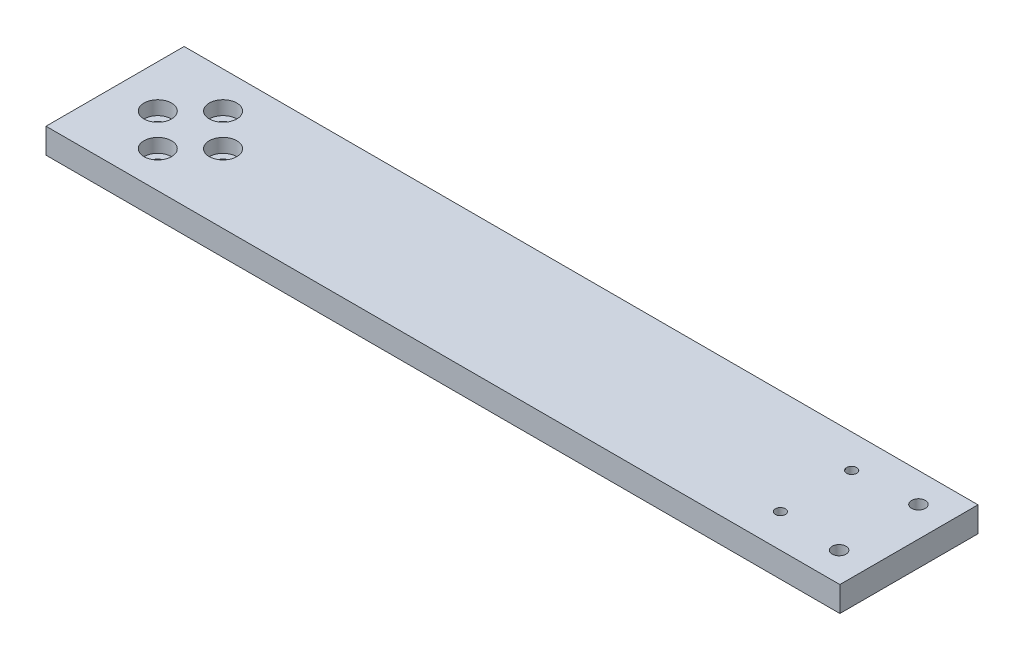
ISO-10303-21;
HEADER;
FILE_DESCRIPTION(('STEP AP214'),'2;1');
FILE_NAME('part.step','',(''),(''),'','','');
FILE_SCHEMA(('AUTOMOTIVE_DESIGN { 1 0 10303 214 1 1 1 1 }'));
ENDSEC;
DATA;
#1=APPLICATION_CONTEXT('core data for automotive mechanical design processes');
#2=APPLICATION_PROTOCOL_DEFINITION('international standard','automotive_design',2000,#1);
#3=PRODUCT_CONTEXT('',#1,'mechanical');
#4=PRODUCT('Part','Part','',(#3));
#5=PRODUCT_RELATED_PRODUCT_CATEGORY('part','',(#4));
#6=PRODUCT_DEFINITION_FORMATION('','',#4);
#7=PRODUCT_DEFINITION_CONTEXT('part definition',#1,'design');
#8=PRODUCT_DEFINITION('design','',#6,#7);
#9=PRODUCT_DEFINITION_SHAPE('','',#8);
#10=(LENGTH_UNIT() NAMED_UNIT(*) SI_UNIT(.MILLI.,.METRE.));
#11=(NAMED_UNIT(*) PLANE_ANGLE_UNIT() SI_UNIT($,.RADIAN.));
#12=(NAMED_UNIT(*) SI_UNIT($,.STERADIAN.) SOLID_ANGLE_UNIT());
#13=UNCERTAINTY_MEASURE_WITH_UNIT(LENGTH_MEASURE(1.E-05),#10,'distance_accuracy_value','');
#14=(GEOMETRIC_REPRESENTATION_CONTEXT(3) GLOBAL_UNCERTAINTY_ASSIGNED_CONTEXT((#13)) GLOBAL_UNIT_ASSIGNED_CONTEXT((#10,
#11,#12)) REPRESENTATION_CONTEXT('',''));
#15=CARTESIAN_POINT('',(0.,0.,0.));
#16=DIRECTION('',(0.,0.,1.));
#17=DIRECTION('',(1.,0.,0.));
#18=AXIS2_PLACEMENT_3D('',#15,#16,#17);
#19=CARTESIAN_POINT('',(30.0000000000002,0.,-14.5000000000003));
#20=DIRECTION('',(0.,1.,0.));
#21=DIRECTION('',(0.,0.,1.00000000000001));
#22=AXIS2_PLACEMENT_3D('',#19,#20,#21);
#23=CYLINDRICAL_SURFACE('',#22,2.75);
#24=CARTESIAN_POINT('',(30.0000000000002,1.1,-14.5000000000003));
#25=DIRECTION('',(0.,-1.,0.));
#26=DIRECTION('',(0.,0.,-1.00000000000001));
#27=AXIS2_PLACEMENT_3D('',#24,#25,#26);
#28=CIRCLE('',#27,2.75);
#29=CARTESIAN_POINT('',(30.0000000000002,1.1,-17.2500000000003));
#30=VERTEX_POINT('',#29);
#31=EDGE_CURVE('E149',#30,#30,#28,.F.);
#32=ORIENTED_EDGE('',*,*,#31,.F.);
#33=EDGE_LOOP('',(#32));
#34=FACE_BOUND('',#33,.T.);
#35=CARTESIAN_POINT('',(30.0000000000002,4.5,-14.5000000000003));
#36=DIRECTION('',(0.,1.,0.));
#37=DIRECTION('',(0.,0.,1.00000000000001));
#38=AXIS2_PLACEMENT_3D('',#35,#36,#37);
#39=CIRCLE('',#38,2.75);
#40=CARTESIAN_POINT('',(30.0000000000002,4.5,-11.7500000000003));
#41=VERTEX_POINT('',#40);
#42=EDGE_CURVE('E49',#41,#41,#39,.F.);
#43=ORIENTED_EDGE('',*,*,#42,.F.);
#44=EDGE_LOOP('',(#43));
#45=FACE_BOUND('',#44,.T.);
#46=ADVANCED_FACE('F45',(#34,#45),#23,.F.);
#47=CARTESIAN_POINT('',(30.,0.,-40.5000000000004));
#48=DIRECTION('',(0.,1.,0.));
#49=DIRECTION('',(0.,0.,1.00000000000001));
#50=AXIS2_PLACEMENT_3D('',#47,#48,#49);
#51=CYLINDRICAL_SURFACE('',#50,2.75);
#52=CARTESIAN_POINT('',(30.,1.1,-40.5000000000004));
#53=DIRECTION('',(0.,-1.,0.));
#54=DIRECTION('',(0.,0.,-1.00000000000001));
#55=AXIS2_PLACEMENT_3D('',#52,#53,#54);
#56=CIRCLE('',#55,2.75);
#57=CARTESIAN_POINT('',(30.,1.1,-43.2500000000004));
#58=VERTEX_POINT('',#57);
#59=EDGE_CURVE('E145',#58,#58,#56,.F.);
#60=ORIENTED_EDGE('',*,*,#59,.F.);
#61=EDGE_LOOP('',(#60));
#62=FACE_BOUND('',#61,.T.);
#63=CARTESIAN_POINT('',(30.,4.5,-40.5000000000004));
#64=DIRECTION('',(0.,1.,0.));
#65=DIRECTION('',(0.,0.,1.00000000000001));
#66=AXIS2_PLACEMENT_3D('',#63,#64,#65);
#67=CIRCLE('',#66,2.75);
#68=CARTESIAN_POINT('',(30.,4.5,-37.7500000000004));
#69=VERTEX_POINT('',#68);
#70=EDGE_CURVE('E163',#69,#69,#67,.F.);
#71=ORIENTED_EDGE('',*,*,#70,.F.);
#72=EDGE_LOOP('',(#71));
#73=FACE_BOUND('',#72,.T.);
#74=ADVANCED_FACE('F344',(#62,#73),#51,.F.);
#75=CARTESIAN_POINT('',(17.0000000000001,0.,-27.5000000000002));
#76=DIRECTION('',(0.,1.,0.));
#77=DIRECTION('',(0.,0.,1.00000000000001));
#78=AXIS2_PLACEMENT_3D('',#75,#76,#77);
#79=CYLINDRICAL_SURFACE('',#78,2.75);
#80=CARTESIAN_POINT('',(17.0000000000001,0.,-27.5000000000002));
#81=DIRECTION('',(0.,1.,0.));
#82=DIRECTION('',(0.,0.,1.00000000000001));
#83=AXIS2_PLACEMENT_3D('',#80,#81,#82);
#84=CIRCLE('',#83,2.75);
#85=CARTESIAN_POINT('',(17.0000000000001,0.,-24.7500000000002));
#86=VERTEX_POINT('',#85);
#87=EDGE_CURVE('E154',#86,#86,#84,.T.);
#88=ORIENTED_EDGE('',*,*,#87,.F.);
#89=EDGE_LOOP('',(#88));
#90=FACE_BOUND('',#89,.T.);
#91=CARTESIAN_POINT('',(17.0000000000001,4.5,-27.5000000000002));
#92=DIRECTION('',(0.,1.,0.));
#93=DIRECTION('',(0.,0.,1.00000000000001));
#94=AXIS2_PLACEMENT_3D('',#91,#92,#93);
#95=CIRCLE('',#94,2.75);
#96=CARTESIAN_POINT('',(17.0000000000001,4.5,-24.7500000000002));
#97=VERTEX_POINT('',#96);
#98=EDGE_CURVE('E159',#97,#97,#95,.F.);
#99=ORIENTED_EDGE('',*,*,#98,.F.);
#100=EDGE_LOOP('',(#99));
#101=FACE_BOUND('',#100,.T.);
#102=ADVANCED_FACE('F350',(#90,#101),#79,.F.);
#103=CARTESIAN_POINT('',(43.0000000000002,0.,-27.5000000000005));
#104=DIRECTION('',(0.,1.,0.));
#105=DIRECTION('',(0.,0.,1.00000000000001));
#106=AXIS2_PLACEMENT_3D('',#103,#104,#105);
#107=CYLINDRICAL_SURFACE('',#106,2.75);
#108=CARTESIAN_POINT('',(43.0000000000002,0.,-27.5000000000005));
#109=DIRECTION('',(0.,1.,0.));
#110=DIRECTION('',(0.,0.,1.00000000000001));
#111=AXIS2_PLACEMENT_3D('',#108,#109,#110);
#112=CIRCLE('',#111,2.75);
#113=CARTESIAN_POINT('',(43.0000000000002,0.,-24.7500000000004));
#114=VERTEX_POINT('',#113);
#115=EDGE_CURVE('E188',#114,#114,#112,.T.);
#116=ORIENTED_EDGE('',*,*,#115,.F.);
#117=EDGE_LOOP('',(#116));
#118=FACE_BOUND('',#117,.T.);
#119=CARTESIAN_POINT('',(43.0000000000002,4.49999999999999,-27.5000000000005));
#120=DIRECTION('',(0.,1.,0.));
#121=DIRECTION('',(0.,0.,1.00000000000001));
#122=AXIS2_PLACEMENT_3D('',#119,#120,#121);
#123=CIRCLE('',#122,2.75);
#124=CARTESIAN_POINT('',(43.0000000000002,4.49999999999999,-24.7500000000004));
#125=VERTEX_POINT('',#124);
#126=EDGE_CURVE('E155',#125,#125,#123,.F.);
#127=ORIENTED_EDGE('',*,*,#126,.F.);
#128=EDGE_LOOP('',(#127));
#129=FACE_BOUND('',#128,.T.);
#130=ADVANCED_FACE('F376',(#118,#129),#107,.F.);
#131=CARTESIAN_POINT('',(304.099999999994,0.,-43.3000000000012));
#132=DIRECTION('',(0.,1.,0.));
#133=DIRECTION('',(0.,0.,1.00000000000001));
#134=AXIS2_PLACEMENT_3D('',#131,#132,#133);
#135=CYLINDRICAL_SURFACE('',#134,2.74999999999998);
#136=CARTESIAN_POINT('',(304.099999999994,10.,-43.3000000000012));
#137=DIRECTION('',(0.,1.,0.));
#138=DIRECTION('',(0.,0.,1.00000000000001));
#139=AXIS2_PLACEMENT_3D('',#136,#137,#138);
#140=CIRCLE('',#139,2.74999999999998);
#141=CARTESIAN_POINT('',(304.099999999994,10.,-40.5500000000012));
#142=VERTEX_POINT('',#141);
#143=EDGE_CURVE('E219',#142,#142,#140,.T.);
#144=ORIENTED_EDGE('',*,*,#143,.T.);
#145=EDGE_LOOP('',(#144));
#146=FACE_BOUND('',#145,.T.);
#147=CARTESIAN_POINT('',(304.099999999994,5.49999999999999,-43.3000000000012));
#148=DIRECTION('',(0.,-1.,0.));
#149=DIRECTION('',(0.,0.,-1.00000000000001));
#150=AXIS2_PLACEMENT_3D('',#147,#148,#149);
#151=CIRCLE('',#150,2.74999999999998);
#152=CARTESIAN_POINT('',(304.099999999994,5.49999999999999,-46.0500000000012));
#153=VERTEX_POINT('',#152);
#154=EDGE_CURVE('E139',#153,#153,#151,.F.);
#155=ORIENTED_EDGE('',*,*,#154,.F.);
#156=EDGE_LOOP('',(#155));
#157=FACE_BOUND('',#156,.T.);
#158=ADVANCED_FACE('F373',(#146,#157),#135,.F.);
#159=CARTESIAN_POINT('',(304.099999999994,0.,-11.700000000001));
#160=DIRECTION('',(0.,1.,0.));
#161=DIRECTION('',(0.,0.,1.00000000000001));
#162=AXIS2_PLACEMENT_3D('',#159,#160,#161);
#163=CYLINDRICAL_SURFACE('',#162,2.74999999999998);
#164=CARTESIAN_POINT('',(304.099999999994,10.,-11.700000000001));
#165=DIRECTION('',(0.,1.,0.));
#166=DIRECTION('',(0.,0.,1.00000000000001));
#167=AXIS2_PLACEMENT_3D('',#164,#165,#166);
#168=CIRCLE('',#167,2.74999999999998);
#169=CARTESIAN_POINT('',(304.099999999994,10.,-8.95000000000105));
#170=VERTEX_POINT('',#169);
#171=EDGE_CURVE('E144',#170,#170,#168,.T.);
#172=ORIENTED_EDGE('',*,*,#171,.T.);
#173=EDGE_LOOP('',(#172));
#174=FACE_BOUND('',#173,.T.);
#175=CARTESIAN_POINT('',(304.099999999994,5.49999999999999,-11.700000000001));
#176=DIRECTION('',(0.,-1.,0.));
#177=DIRECTION('',(0.,0.,-1.00000000000001));
#178=AXIS2_PLACEMENT_3D('',#175,#176,#177);
#179=CIRCLE('',#178,2.74999999999998);
#180=CARTESIAN_POINT('',(304.099999999994,5.49999999999999,-14.450000000001));
#181=VERTEX_POINT('',#180);
#182=EDGE_CURVE('E135',#181,#181,#179,.F.);
#183=ORIENTED_EDGE('',*,*,#182,.F.);
#184=EDGE_LOOP('',(#183));
#185=FACE_BOUND('',#184,.T.);
#186=ADVANCED_FACE('F375',(#174,#185),#163,.F.);
#187=CARTESIAN_POINT('',(0.,10.,0.));
#188=DIRECTION('',(0.,0.,-1.00000000000001));
#189=DIRECTION('',(-1.00000000000001,0.,0.));
#190=AXIS2_PLACEMENT_3D('',#187,#188,#189);
#191=PLANE('',#190);
#192=DIRECTION('',(1.00000000000001,0.,0.));
#193=VECTOR('',#192,1.);
#194=CARTESIAN_POINT('',(0.,0.,0.));
#195=LINE('',#194,#193);
#196=CARTESIAN_POINT('',(0.,0.,0.));
#197=VERTEX_POINT('',#196);
#198=CARTESIAN_POINT('',(316.100000000002,0.,0.));
#199=VERTEX_POINT('',#198);
#200=EDGE_CURVE('E118',#197,#199,#195,.T.);
#201=ORIENTED_EDGE('',*,*,#200,.T.);
#202=DIRECTION('',(0.,-1.,0.));
#203=VECTOR('',#202,1.);
#204=CARTESIAN_POINT('',(316.100000000002,9.99999999999998,0.));
#205=LINE('',#204,#203);
#206=CARTESIAN_POINT('',(316.100000000002,9.99999999999998,0.));
#207=VERTEX_POINT('',#206);
#208=EDGE_CURVE('E11',#207,#199,#205,.T.);
#209=ORIENTED_EDGE('',*,*,#208,.F.);
#210=DIRECTION('',(1.00000000000001,0.,0.));
#211=VECTOR('',#210,1.);
#212=CARTESIAN_POINT('',(0.,10.,0.));
#213=LINE('',#212,#211);
#214=CARTESIAN_POINT('',(0.,10.,0.));
#215=VERTEX_POINT('',#214);
#216=EDGE_CURVE('E98',#215,#207,#213,.T.);
#217=ORIENTED_EDGE('',*,*,#216,.F.);
#218=DIRECTION('',(0.,-1.,0.));
#219=VECTOR('',#218,1.);
#220=CARTESIAN_POINT('',(0.,10.,0.));
#221=LINE('',#220,#219);
#222=EDGE_CURVE('E65',#215,#197,#221,.T.);
#223=ORIENTED_EDGE('',*,*,#222,.T.);
#224=EDGE_LOOP('',(#201,#209,#217,#223));
#225=FACE_BOUND('',#224,.T.);
#226=ADVANCED_FACE('F47',(#225),#191,.F.);
#227=CARTESIAN_POINT('',(316.100000000002,9.99999999999998,0.));
#228=DIRECTION('',(-1.00000000000001,0.,0.));
#229=DIRECTION('',(0.,0.,1.00000000000001));
#230=AXIS2_PLACEMENT_3D('',#227,#228,#229);
#231=PLANE('',#230);
#232=DIRECTION('',(0.,0.,-1.00000000000001));
#233=VECTOR('',#232,1.);
#234=CARTESIAN_POINT('',(316.100000000002,0.,0.));
#235=LINE('',#234,#233);
#236=CARTESIAN_POINT('',(316.100000000002,0.,-55.0000000000004));
#237=VERTEX_POINT('',#236);
#238=EDGE_CURVE('E104',#199,#237,#235,.T.);
#239=ORIENTED_EDGE('',*,*,#238,.T.);
#240=DIRECTION('',(0.,-1.,0.));
#241=VECTOR('',#240,1.);
#242=CARTESIAN_POINT('',(316.100000000002,9.99999999999998,-55.0000000000004));
#243=LINE('',#242,#241);
#244=CARTESIAN_POINT('',(316.100000000002,9.99999999999998,-55.0000000000004));
#245=VERTEX_POINT('',#244);
#246=EDGE_CURVE('E56',#245,#237,#243,.T.);
#247=ORIENTED_EDGE('',*,*,#246,.F.);
#248=DIRECTION('',(0.,0.,-1.00000000000001));
#249=VECTOR('',#248,1.);
#250=CARTESIAN_POINT('',(316.100000000002,9.99999999999998,0.));
#251=LINE('',#250,#249);
#252=EDGE_CURVE('E90',#207,#245,#251,.T.);
#253=ORIENTED_EDGE('',*,*,#252,.F.);
#254=ORIENTED_EDGE('',*,*,#208,.T.);
#255=EDGE_LOOP('',(#239,#247,#253,#254));
#256=FACE_BOUND('',#255,.T.);
#257=ADVANCED_FACE('F103',(#256),#231,.F.);
#258=CARTESIAN_POINT('',(0.,10.,-55.0000000000004));
#259=DIRECTION('',(0.,0.,-1.00000000000001));
#260=DIRECTION('',(-1.00000000000001,0.,0.));
#261=AXIS2_PLACEMENT_3D('',#258,#259,#260);
#262=PLANE('',#261);
#263=DIRECTION('',(1.00000000000001,0.,0.));
#264=VECTOR('',#263,1.);
#265=CARTESIAN_POINT('',(0.,0.,-55.0000000000004));
#266=LINE('',#265,#264);
#267=CARTESIAN_POINT('',(0.,0.,-55.0000000000004));
#268=VERTEX_POINT('',#267);
#269=EDGE_CURVE('E124',#268,#237,#266,.T.);
#270=ORIENTED_EDGE('',*,*,#269,.F.);
#271=DIRECTION('',(0.,-1.,0.));
#272=VECTOR('',#271,1.);
#273=CARTESIAN_POINT('',(0.,10.,-55.0000000000004));
#274=LINE('',#273,#272);
#275=CARTESIAN_POINT('',(0.,10.,-55.0000000000004));
#276=VERTEX_POINT('',#275);
#277=EDGE_CURVE('E79',#276,#268,#274,.T.);
#278=ORIENTED_EDGE('',*,*,#277,.F.);
#279=DIRECTION('',(1.00000000000001,0.,0.));
#280=VECTOR('',#279,1.);
#281=CARTESIAN_POINT('',(0.,10.,-55.0000000000004));
#282=LINE('',#281,#280);
#283=EDGE_CURVE('E97',#276,#245,#282,.T.);
#284=ORIENTED_EDGE('',*,*,#283,.T.);
#285=ORIENTED_EDGE('',*,*,#246,.T.);
#286=EDGE_LOOP('',(#270,#278,#284,#285));
#287=FACE_BOUND('',#286,.T.);
#288=ADVANCED_FACE('F109',(#287),#262,.T.);
#289=CARTESIAN_POINT('',(0.,10.,0.));
#290=DIRECTION('',(-1.00000000000001,0.,0.));
#291=DIRECTION('',(0.,0.,1.00000000000001));
#292=AXIS2_PLACEMENT_3D('',#289,#290,#291);
#293=PLANE('',#292);
#294=DIRECTION('',(0.,0.,-1.00000000000001));
#295=VECTOR('',#294,1.);
#296=CARTESIAN_POINT('',(0.,0.,0.));
#297=LINE('',#296,#295);
#298=EDGE_CURVE('E127',#197,#268,#297,.T.);
#299=ORIENTED_EDGE('',*,*,#298,.F.);
#300=ORIENTED_EDGE('',*,*,#222,.F.);
#301=DIRECTION('',(0.,0.,-1.00000000000001));
#302=VECTOR('',#301,1.);
#303=CARTESIAN_POINT('',(0.,10.,0.));
#304=LINE('',#303,#302);
#305=EDGE_CURVE('E111',#215,#276,#304,.T.);
#306=ORIENTED_EDGE('',*,*,#305,.T.);
#307=ORIENTED_EDGE('',*,*,#277,.T.);
#308=EDGE_LOOP('',(#299,#300,#306,#307));
#309=FACE_BOUND('',#308,.T.);
#310=ADVANCED_FACE('F311',(#309),#293,.T.);
#311=CARTESIAN_POINT('',(0.,10.,0.));
#312=DIRECTION('',(0.,1.,0.));
#313=DIRECTION('',(0.,0.,1.00000000000001));
#314=AXIS2_PLACEMENT_3D('',#311,#312,#313);
#315=PLANE('',#314);
#316=CARTESIAN_POINT('',(16.9999999999985,10.,-27.5000000000017));
#317=DIRECTION('',(0.,1.,0.));
#318=DIRECTION('',(0.,0.,1.00000000000001));
#319=AXIS2_PLACEMENT_3D('',#316,#317,#318);
#320=CIRCLE('',#319,5.5);
#321=CARTESIAN_POINT('',(16.9999999999985,10.,-22.0000000000017));
#322=VERTEX_POINT('',#321);
#323=EDGE_CURVE('E289',#322,#322,#320,.T.);
#324=ORIENTED_EDGE('',*,*,#323,.F.);
#325=EDGE_LOOP('',(#324));
#326=FACE_BOUND('',#325,.T.);
#327=CARTESIAN_POINT('',(29.9999999999982,10.,-40.500000000002));
#328=DIRECTION('',(0.,1.,0.));
#329=DIRECTION('',(0.,0.,1.00000000000001));
#330=AXIS2_PLACEMENT_3D('',#327,#328,#329);
#331=CIRCLE('',#330,5.5);
#332=CARTESIAN_POINT('',(29.9999999999982,10.,-35.000000000002));
#333=VERTEX_POINT('',#332);
#334=EDGE_CURVE('E281',#333,#333,#331,.T.);
#335=ORIENTED_EDGE('',*,*,#334,.F.);
#336=EDGE_LOOP('',(#335));
#337=FACE_BOUND('',#336,.T.);
#338=CARTESIAN_POINT('',(42.9999999999986,10.,-27.5000000000023));
#339=DIRECTION('',(0.,1.,0.));
#340=DIRECTION('',(0.,0.,1.00000000000001));
#341=AXIS2_PLACEMENT_3D('',#338,#339,#340);
#342=CIRCLE('',#341,5.5);
#343=CARTESIAN_POINT('',(42.9999999999986,10.,-22.0000000000022));
#344=VERTEX_POINT('',#343);
#345=EDGE_CURVE('E273',#344,#344,#342,.T.);
#346=ORIENTED_EDGE('',*,*,#345,.F.);
#347=EDGE_LOOP('',(#346));
#348=FACE_BOUND('',#347,.T.);
#349=CARTESIAN_POINT('',(29.9999999999988,10.,-14.5000000000019));
#350=DIRECTION('',(0.,1.,0.));
#351=DIRECTION('',(0.,0.,1.00000000000001));
#352=AXIS2_PLACEMENT_3D('',#349,#350,#351);
#353=CIRCLE('',#352,5.5);
#354=CARTESIAN_POINT('',(29.9999999999988,10.,-9.00000000000186));
#355=VERTEX_POINT('',#354);
#356=EDGE_CURVE('E265',#355,#355,#353,.T.);
#357=ORIENTED_EDGE('',*,*,#356,.F.);
#358=EDGE_LOOP('',(#357));
#359=FACE_BOUND('',#358,.T.);
#360=ORIENTED_EDGE('',*,*,#171,.F.);
#361=EDGE_LOOP('',(#360));
#362=FACE_BOUND('',#361,.T.);
#363=ORIENTED_EDGE('',*,*,#143,.F.);
#364=EDGE_LOOP('',(#363));
#365=FACE_BOUND('',#364,.T.);
#366=CARTESIAN_POINT('',(279.099999999994,10.,-41.7000000000013));
#367=DIRECTION('',(0.,1.,0.));
#368=DIRECTION('',(0.,0.,1.00000000000001));
#369=AXIS2_PLACEMENT_3D('',#366,#367,#368);
#370=CIRCLE('',#369,2.);
#371=CARTESIAN_POINT('',(279.099999999994,10.,-39.7000000000012));
#372=VERTEX_POINT('',#371);
#373=EDGE_CURVE('E215',#372,#372,#370,.T.);
#374=ORIENTED_EDGE('',*,*,#373,.F.);
#375=EDGE_LOOP('',(#374));
#376=FACE_BOUND('',#375,.T.);
#377=CARTESIAN_POINT('',(279.099999999994,10.,-13.3000000000011));
#378=DIRECTION('',(0.,1.,0.));
#379=DIRECTION('',(0.,0.,1.00000000000001));
#380=AXIS2_PLACEMENT_3D('',#377,#378,#379);
#381=CIRCLE('',#380,2.);
#382=CARTESIAN_POINT('',(279.099999999994,10.,-11.3000000000011));
#383=VERTEX_POINT('',#382);
#384=EDGE_CURVE('E214',#383,#383,#381,.T.);
#385=ORIENTED_EDGE('',*,*,#384,.F.);
#386=EDGE_LOOP('',(#385));
#387=FACE_BOUND('',#386,.T.);
#388=ORIENTED_EDGE('',*,*,#216,.T.);
#389=ORIENTED_EDGE('',*,*,#252,.T.);
#390=ORIENTED_EDGE('',*,*,#283,.F.);
#391=ORIENTED_EDGE('',*,*,#305,.F.);
#392=EDGE_LOOP('',(#388,#389,#390,#391));
#393=FACE_BOUND('',#392,.T.);
#394=ADVANCED_FACE('F94',(#326,#337,#348,#359,#362,#365,#376,#387,#393),#315,.T.);
#395=CARTESIAN_POINT('',(0.,0.,0.));
#396=DIRECTION('',(0.,1.,0.));
#397=DIRECTION('',(0.,0.,1.00000000000001));
#398=AXIS2_PLACEMENT_3D('',#395,#396,#397);
#399=PLANE('',#398);
#400=CARTESIAN_POINT('',(30.0000000000002,0.,-14.5000000000003));
#401=DIRECTION('',(0.,-1.,0.));
#402=DIRECTION('',(0.,0.,-1.00000000000001));
#403=AXIS2_PLACEMENT_3D('',#400,#401,#402);
#404=CIRCLE('',#403,4.5);
#405=CARTESIAN_POINT('',(30.0000000000002,0.,-19.0000000000003));
#406=VERTEX_POINT('',#405);
#407=EDGE_CURVE('E184',#406,#406,#404,.T.);
#408=ORIENTED_EDGE('',*,*,#407,.F.);
#409=EDGE_LOOP('',(#408));
#410=FACE_BOUND('',#409,.T.);
#411=CARTESIAN_POINT('',(30.,0.,-40.5000000000004));
#412=DIRECTION('',(0.,-1.,0.));
#413=DIRECTION('',(0.,0.,-1.00000000000001));
#414=AXIS2_PLACEMENT_3D('',#411,#412,#413);
#415=CIRCLE('',#414,4.5);
#416=CARTESIAN_POINT('',(30.,0.,-45.0000000000004));
#417=VERTEX_POINT('',#416);
#418=EDGE_CURVE('E171',#417,#417,#415,.T.);
#419=ORIENTED_EDGE('',*,*,#418,.F.);
#420=EDGE_LOOP('',(#419));
#421=FACE_BOUND('',#420,.T.);
#422=ORIENTED_EDGE('',*,*,#115,.T.);
#423=EDGE_LOOP('',(#422));
#424=FACE_BOUND('',#423,.T.);
#425=ORIENTED_EDGE('',*,*,#87,.T.);
#426=EDGE_LOOP('',(#425));
#427=FACE_BOUND('',#426,.T.);
#428=CARTESIAN_POINT('',(304.099999999994,0.,-11.700000000001));
#429=DIRECTION('',(0.,-1.,0.));
#430=DIRECTION('',(0.,0.,-1.00000000000001));
#431=AXIS2_PLACEMENT_3D('',#428,#429,#430);
#432=CIRCLE('',#431,5.50000000000002);
#433=CARTESIAN_POINT('',(304.099999999994,0.,-17.2000000000011));
#434=VERTEX_POINT('',#433);
#435=EDGE_CURVE('E199',#434,#434,#432,.T.);
#436=ORIENTED_EDGE('',*,*,#435,.F.);
#437=EDGE_LOOP('',(#436));
#438=FACE_BOUND('',#437,.T.);
#439=CARTESIAN_POINT('',(304.099999999994,0.,-43.3000000000012));
#440=DIRECTION('',(0.,-1.,0.));
#441=DIRECTION('',(0.,0.,-1.00000000000001));
#442=AXIS2_PLACEMENT_3D('',#439,#440,#441);
#443=CIRCLE('',#442,5.50000000000002);
#444=CARTESIAN_POINT('',(304.099999999994,0.,-48.8000000000012));
#445=VERTEX_POINT('',#444);
#446=EDGE_CURVE('E192',#445,#445,#443,.T.);
#447=ORIENTED_EDGE('',*,*,#446,.F.);
#448=EDGE_LOOP('',(#447));
#449=FACE_BOUND('',#448,.T.);
#450=CARTESIAN_POINT('',(279.099999999994,0.,-41.7000000000013));
#451=DIRECTION('',(0.,1.,0.));
#452=DIRECTION('',(0.,0.,1.00000000000001));
#453=AXIS2_PLACEMENT_3D('',#450,#451,#452);
#454=CIRCLE('',#453,2.);
#455=CARTESIAN_POINT('',(279.099999999994,0.,-39.7000000000012));
#456=VERTEX_POINT('',#455);
#457=EDGE_CURVE('E210',#456,#456,#454,.T.);
#458=ORIENTED_EDGE('',*,*,#457,.T.);
#459=EDGE_LOOP('',(#458));
#460=FACE_BOUND('',#459,.T.);
#461=CARTESIAN_POINT('',(279.099999999994,0.,-13.3000000000011));
#462=DIRECTION('',(0.,1.,0.));
#463=DIRECTION('',(0.,0.,1.00000000000001));
#464=AXIS2_PLACEMENT_3D('',#461,#462,#463);
#465=CIRCLE('',#464,2.);
#466=CARTESIAN_POINT('',(279.099999999994,0.,-11.3000000000011));
#467=VERTEX_POINT('',#466);
#468=EDGE_CURVE('E121',#467,#467,#465,.T.);
#469=ORIENTED_EDGE('',*,*,#468,.T.);
#470=EDGE_LOOP('',(#469));
#471=FACE_BOUND('',#470,.T.);
#472=ORIENTED_EDGE('',*,*,#200,.F.);
#473=ORIENTED_EDGE('',*,*,#298,.T.);
#474=ORIENTED_EDGE('',*,*,#269,.T.);
#475=ORIENTED_EDGE('',*,*,#238,.F.);
#476=EDGE_LOOP('',(#472,#473,#474,#475));
#477=FACE_BOUND('',#476,.T.);
#478=ADVANCED_FACE('F310',(#410,#421,#424,#427,#438,#449,#460,#471,#477),#399,.F.);
#479=CARTESIAN_POINT('',(279.099999999994,0.,-13.3000000000011));
#480=DIRECTION('',(0.,1.,0.));
#481=DIRECTION('',(0.,0.,1.00000000000001));
#482=AXIS2_PLACEMENT_3D('',#479,#480,#481);
#483=CYLINDRICAL_SURFACE('',#482,2.);
#484=ORIENTED_EDGE('',*,*,#468,.F.);
#485=EDGE_LOOP('',(#484));
#486=FACE_BOUND('',#485,.T.);
#487=ORIENTED_EDGE('',*,*,#384,.T.);
#488=EDGE_LOOP('',(#487));
#489=FACE_BOUND('',#488,.T.);
#490=ADVANCED_FACE('F327',(#486,#489),#483,.F.);
#491=CARTESIAN_POINT('',(279.099999999994,0.,-41.7000000000013));
#492=DIRECTION('',(0.,1.,0.));
#493=DIRECTION('',(0.,0.,1.00000000000001));
#494=AXIS2_PLACEMENT_3D('',#491,#492,#493);
#495=CYLINDRICAL_SURFACE('',#494,2.);
#496=ORIENTED_EDGE('',*,*,#457,.F.);
#497=EDGE_LOOP('',(#496));
#498=FACE_BOUND('',#497,.T.);
#499=ORIENTED_EDGE('',*,*,#373,.T.);
#500=EDGE_LOOP('',(#499));
#501=FACE_BOUND('',#500,.T.);
#502=ADVANCED_FACE('F329',(#498,#501),#495,.F.);
#503=CARTESIAN_POINT('',(304.099999999994,5.49999999999999,-11.700000000001));
#504=DIRECTION('',(0.,-1.,0.));
#505=DIRECTION('',(0.,0.,-1.00000000000001));
#506=AXIS2_PLACEMENT_3D('',#503,#504,#505);
#507=PLANE('',#506);
#508=CARTESIAN_POINT('',(304.099999999994,5.49999999999999,-11.700000000001));
#509=DIRECTION('',(0.,-1.,0.));
#510=DIRECTION('',(0.,0.,-1.00000000000001));
#511=AXIS2_PLACEMENT_3D('',#508,#509,#510);
#512=CIRCLE('',#511,5.50000000000002);
#513=CARTESIAN_POINT('',(304.099999999994,5.49999999999999,-17.2000000000011));
#514=VERTEX_POINT('',#513);
#515=EDGE_CURVE('E140',#514,#514,#512,.T.);
#516=ORIENTED_EDGE('',*,*,#515,.T.);
#517=EDGE_LOOP('',(#516));
#518=FACE_BOUND('',#517,.T.);
#519=ORIENTED_EDGE('',*,*,#182,.T.);
#520=EDGE_LOOP('',(#519));
#521=FACE_BOUND('',#520,.T.);
#522=ADVANCED_FACE('F336',(#518,#521),#507,.T.);
#523=CARTESIAN_POINT('',(304.099999999994,5.49999999999999,-11.700000000001));
#524=DIRECTION('',(0.,-1.,0.));
#525=DIRECTION('',(0.,0.,-1.00000000000001));
#526=AXIS2_PLACEMENT_3D('',#523,#524,#525);
#527=CYLINDRICAL_SURFACE('',#526,5.50000000000002);
#528=ORIENTED_EDGE('',*,*,#515,.F.);
#529=EDGE_LOOP('',(#528));
#530=FACE_BOUND('',#529,.T.);
#531=ORIENTED_EDGE('',*,*,#435,.T.);
#532=EDGE_LOOP('',(#531));
#533=FACE_BOUND('',#532,.T.);
#534=ADVANCED_FACE('F359',(#530,#533),#527,.F.);
#535=CARTESIAN_POINT('',(304.099999999994,5.49999999999999,-43.3000000000012));
#536=DIRECTION('',(0.,-1.,0.));
#537=DIRECTION('',(0.,0.,-1.00000000000001));
#538=AXIS2_PLACEMENT_3D('',#535,#536,#537);
#539=PLANE('',#538);
#540=CARTESIAN_POINT('',(304.099999999994,5.49999999999999,-43.3000000000012));
#541=DIRECTION('',(0.,-1.,0.));
#542=DIRECTION('',(0.,0.,-1.00000000000001));
#543=AXIS2_PLACEMENT_3D('',#540,#541,#542);
#544=CIRCLE('',#543,5.50000000000002);
#545=CARTESIAN_POINT('',(304.099999999994,5.49999999999999,-48.8000000000012));
#546=VERTEX_POINT('',#545);
#547=EDGE_CURVE('E203',#546,#546,#544,.T.);
#548=ORIENTED_EDGE('',*,*,#547,.T.);
#549=EDGE_LOOP('',(#548));
#550=FACE_BOUND('',#549,.T.);
#551=ORIENTED_EDGE('',*,*,#154,.T.);
#552=EDGE_LOOP('',(#551));
#553=FACE_BOUND('',#552,.T.);
#554=ADVANCED_FACE('F363',(#550,#553),#539,.T.);
#555=CARTESIAN_POINT('',(304.099999999994,5.49999999999999,-43.3000000000012));
#556=DIRECTION('',(0.,-1.,0.));
#557=DIRECTION('',(0.,0.,-1.00000000000001));
#558=AXIS2_PLACEMENT_3D('',#555,#556,#557);
#559=CYLINDRICAL_SURFACE('',#558,5.50000000000002);
#560=ORIENTED_EDGE('',*,*,#547,.F.);
#561=EDGE_LOOP('',(#560));
#562=FACE_BOUND('',#561,.T.);
#563=ORIENTED_EDGE('',*,*,#446,.T.);
#564=EDGE_LOOP('',(#563));
#565=FACE_BOUND('',#564,.T.);
#566=ADVANCED_FACE('F367',(#562,#565),#559,.F.);
#567=CARTESIAN_POINT('',(30.,1.1,-40.5000000000004));
#568=DIRECTION('',(0.,-1.,0.));
#569=DIRECTION('',(0.,0.,-1.00000000000001));
#570=AXIS2_PLACEMENT_3D('',#567,#568,#569);
#571=PLANE('',#570);
#572=CARTESIAN_POINT('',(30.,1.1,-40.5000000000004));
#573=DIRECTION('',(0.,-1.,0.));
#574=DIRECTION('',(0.,0.,-1.00000000000001));
#575=AXIS2_PLACEMENT_3D('',#572,#573,#574);
#576=CIRCLE('',#575,4.5);
#577=CARTESIAN_POINT('',(30.,1.1,-45.0000000000004));
#578=VERTEX_POINT('',#577);
#579=EDGE_CURVE('E177',#578,#578,#576,.T.);
#580=ORIENTED_EDGE('',*,*,#579,.T.);
#581=EDGE_LOOP('',(#580));
#582=FACE_BOUND('',#581,.T.);
#583=ORIENTED_EDGE('',*,*,#59,.T.);
#584=EDGE_LOOP('',(#583));
#585=FACE_BOUND('',#584,.T.);
#586=ADVANCED_FACE('F370',(#582,#585),#571,.T.);
#587=CARTESIAN_POINT('',(30.,1.1,-40.5000000000004));
#588=DIRECTION('',(0.,-1.,0.));
#589=DIRECTION('',(0.,0.,-1.00000000000001));
#590=AXIS2_PLACEMENT_3D('',#587,#588,#589);
#591=CYLINDRICAL_SURFACE('',#590,4.5);
#592=ORIENTED_EDGE('',*,*,#579,.F.);
#593=EDGE_LOOP('',(#592));
#594=FACE_BOUND('',#593,.T.);
#595=ORIENTED_EDGE('',*,*,#418,.T.);
#596=EDGE_LOOP('',(#595));
#597=FACE_BOUND('',#596,.T.);
#598=ADVANCED_FACE('F535',(#594,#597),#591,.F.);
#599=CARTESIAN_POINT('',(30.0000000000002,1.1,-14.5000000000003));
#600=DIRECTION('',(0.,-1.,0.));
#601=DIRECTION('',(0.,0.,-1.00000000000001));
#602=AXIS2_PLACEMENT_3D('',#599,#600,#601);
#603=PLANE('',#602);
#604=CARTESIAN_POINT('',(30.0000000000002,1.1,-14.5000000000003));
#605=DIRECTION('',(0.,-1.,0.));
#606=DIRECTION('',(0.,0.,-1.00000000000001));
#607=AXIS2_PLACEMENT_3D('',#604,#605,#606);
#608=CIRCLE('',#607,4.5);
#609=CARTESIAN_POINT('',(30.0000000000002,1.1,-19.0000000000003));
#610=VERTEX_POINT('',#609);
#611=EDGE_CURVE('E150',#610,#610,#608,.T.);
#612=ORIENTED_EDGE('',*,*,#611,.T.);
#613=EDGE_LOOP('',(#612));
#614=FACE_BOUND('',#613,.T.);
#615=ORIENTED_EDGE('',*,*,#31,.T.);
#616=EDGE_LOOP('',(#615));
#617=FACE_BOUND('',#616,.T.);
#618=ADVANCED_FACE('F528',(#614,#617),#603,.T.);
#619=CARTESIAN_POINT('',(30.0000000000002,1.1,-14.5000000000003));
#620=DIRECTION('',(0.,-1.,0.));
#621=DIRECTION('',(0.,0.,-1.00000000000001));
#622=AXIS2_PLACEMENT_3D('',#619,#620,#621);
#623=CYLINDRICAL_SURFACE('',#622,4.5);
#624=ORIENTED_EDGE('',*,*,#611,.F.);
#625=EDGE_LOOP('',(#624));
#626=FACE_BOUND('',#625,.T.);
#627=ORIENTED_EDGE('',*,*,#407,.T.);
#628=EDGE_LOOP('',(#627));
#629=FACE_BOUND('',#628,.T.);
#630=ADVANCED_FACE('F458',(#626,#629),#623,.F.);
#631=CARTESIAN_POINT('',(42.9999999999986,4.49999999999999,-27.5000000000023));
#632=DIRECTION('',(0.,1.,0.));
#633=DIRECTION('',(0.,0.,1.00000000000001));
#634=AXIS2_PLACEMENT_3D('',#631,#632,#633);
#635=PLANE('',#634);
#636=CARTESIAN_POINT('',(42.9999999999986,4.49999999999999,-27.5000000000023));
#637=DIRECTION('',(0.,1.,0.));
#638=DIRECTION('',(0.,0.,1.00000000000001));
#639=AXIS2_PLACEMENT_3D('',#636,#637,#638);
#640=CIRCLE('',#639,5.5);
#641=CARTESIAN_POINT('',(42.9999999999986,4.49999999999999,-22.0000000000022));
#642=VERTEX_POINT('',#641);
#643=EDGE_CURVE('E277',#642,#642,#640,.T.);
#644=ORIENTED_EDGE('',*,*,#643,.T.);
#645=EDGE_LOOP('',(#644));
#646=FACE_BOUND('',#645,.T.);
#647=ORIENTED_EDGE('',*,*,#126,.T.);
#648=EDGE_LOOP('',(#647));
#649=FACE_BOUND('',#648,.T.);
#650=ADVANCED_FACE('F451',(#646,#649),#635,.T.);
#651=CARTESIAN_POINT('',(42.9999999999986,4.49999999999999,-27.5000000000023));
#652=DIRECTION('',(0.,1.,0.));
#653=DIRECTION('',(0.,0.,1.00000000000001));
#654=AXIS2_PLACEMENT_3D('',#651,#652,#653);
#655=CYLINDRICAL_SURFACE('',#654,5.5);
#656=ORIENTED_EDGE('',*,*,#643,.F.);
#657=EDGE_LOOP('',(#656));
#658=FACE_BOUND('',#657,.T.);
#659=ORIENTED_EDGE('',*,*,#345,.T.);
#660=EDGE_LOOP('',(#659));
#661=FACE_BOUND('',#660,.T.);
#662=ADVANCED_FACE('F457',(#658,#661),#655,.F.);
#663=CARTESIAN_POINT('',(16.9999999999985,4.5,-27.5000000000017));
#664=DIRECTION('',(0.,1.,0.));
#665=DIRECTION('',(0.,0.,1.00000000000001));
#666=AXIS2_PLACEMENT_3D('',#663,#664,#665);
#667=PLANE('',#666);
#668=CARTESIAN_POINT('',(16.9999999999985,4.5,-27.5000000000017));
#669=DIRECTION('',(0.,1.,0.));
#670=DIRECTION('',(0.,0.,1.00000000000001));
#671=AXIS2_PLACEMENT_3D('',#668,#669,#670);
#672=CIRCLE('',#671,5.5);
#673=CARTESIAN_POINT('',(16.9999999999985,4.5,-22.0000000000017));
#674=VERTEX_POINT('',#673);
#675=EDGE_CURVE('E160',#674,#674,#672,.T.);
#676=ORIENTED_EDGE('',*,*,#675,.T.);
#677=EDGE_LOOP('',(#676));
#678=FACE_BOUND('',#677,.T.);
#679=ORIENTED_EDGE('',*,*,#98,.T.);
#680=EDGE_LOOP('',(#679));
#681=FACE_BOUND('',#680,.T.);
#682=ADVANCED_FACE('F298',(#678,#681),#667,.T.);
#683=CARTESIAN_POINT('',(16.9999999999985,4.5,-27.5000000000017));
#684=DIRECTION('',(0.,1.,0.));
#685=DIRECTION('',(0.,0.,1.00000000000001));
#686=AXIS2_PLACEMENT_3D('',#683,#684,#685);
#687=CYLINDRICAL_SURFACE('',#686,5.5);
#688=ORIENTED_EDGE('',*,*,#675,.F.);
#689=EDGE_LOOP('',(#688));
#690=FACE_BOUND('',#689,.T.);
#691=ORIENTED_EDGE('',*,*,#323,.T.);
#692=EDGE_LOOP('',(#691));
#693=FACE_BOUND('',#692,.T.);
#694=ADVANCED_FACE('F301',(#690,#693),#687,.F.);
#695=CARTESIAN_POINT('',(29.9999999999988,4.5,-14.5000000000019));
#696=DIRECTION('',(0.,1.,0.));
#697=DIRECTION('',(0.,0.,1.00000000000001));
#698=AXIS2_PLACEMENT_3D('',#695,#696,#697);
#699=PLANE('',#698);
#700=CARTESIAN_POINT('',(29.9999999999988,4.5,-14.5000000000019));
#701=DIRECTION('',(0.,1.,0.));
#702=DIRECTION('',(0.,0.,1.00000000000001));
#703=AXIS2_PLACEMENT_3D('',#700,#701,#702);
#704=CIRCLE('',#703,5.5);
#705=CARTESIAN_POINT('',(29.9999999999988,4.5,-9.00000000000186));
#706=VERTEX_POINT('',#705);
#707=EDGE_CURVE('E269',#706,#706,#704,.T.);
#708=ORIENTED_EDGE('',*,*,#707,.T.);
#709=EDGE_LOOP('',(#708));
#710=FACE_BOUND('',#709,.T.);
#711=ORIENTED_EDGE('',*,*,#42,.T.);
#712=EDGE_LOOP('',(#711));
#713=FACE_BOUND('',#712,.T.);
#714=ADVANCED_FACE('F304',(#710,#713),#699,.T.);
#715=CARTESIAN_POINT('',(29.9999999999988,4.5,-14.5000000000019));
#716=DIRECTION('',(0.,1.,0.));
#717=DIRECTION('',(0.,0.,1.00000000000001));
#718=AXIS2_PLACEMENT_3D('',#715,#716,#717);
#719=CYLINDRICAL_SURFACE('',#718,5.5);
#720=ORIENTED_EDGE('',*,*,#707,.F.);
#721=EDGE_LOOP('',(#720));
#722=FACE_BOUND('',#721,.T.);
#723=ORIENTED_EDGE('',*,*,#356,.T.);
#724=EDGE_LOOP('',(#723));
#725=FACE_BOUND('',#724,.T.);
#726=ADVANCED_FACE('F488',(#722,#725),#719,.F.);
#727=CARTESIAN_POINT('',(29.9999999999982,4.5,-40.500000000002));
#728=DIRECTION('',(0.,1.,0.));
#729=DIRECTION('',(0.,0.,1.00000000000001));
#730=AXIS2_PLACEMENT_3D('',#727,#728,#729);
#731=PLANE('',#730);
#732=CARTESIAN_POINT('',(29.9999999999982,4.5,-40.500000000002));
#733=DIRECTION('',(0.,1.,0.));
#734=DIRECTION('',(0.,0.,1.00000000000001));
#735=AXIS2_PLACEMENT_3D('',#732,#733,#734);
#736=CIRCLE('',#735,5.5);
#737=CARTESIAN_POINT('',(29.9999999999982,4.5,-35.000000000002));
#738=VERTEX_POINT('',#737);
#739=EDGE_CURVE('E285',#738,#738,#736,.T.);
#740=ORIENTED_EDGE('',*,*,#739,.T.);
#741=EDGE_LOOP('',(#740));
#742=FACE_BOUND('',#741,.T.);
#743=ORIENTED_EDGE('',*,*,#70,.T.);
#744=EDGE_LOOP('',(#743));
#745=FACE_BOUND('',#744,.T.);
#746=ADVANCED_FACE('F497',(#742,#745),#731,.T.);
#747=CARTESIAN_POINT('',(29.9999999999982,4.5,-40.500000000002));
#748=DIRECTION('',(0.,1.,0.));
#749=DIRECTION('',(0.,0.,1.00000000000001));
#750=AXIS2_PLACEMENT_3D('',#747,#748,#749);
#751=CYLINDRICAL_SURFACE('',#750,5.5);
#752=ORIENTED_EDGE('',*,*,#739,.F.);
#753=EDGE_LOOP('',(#752));
#754=FACE_BOUND('',#753,.T.);
#755=ORIENTED_EDGE('',*,*,#334,.T.);
#756=EDGE_LOOP('',(#755));
#757=FACE_BOUND('',#756,.T.);
#758=ADVANCED_FACE('F506',(#754,#757),#751,.F.);
#759=CLOSED_SHELL('',(#46,#74,#102,#130,#158,#186,#226,#257,#288,#310,#394,#478,#490,#502,#522,
#534,#554,#566,#586,#598,#618,#630,#650,#662,#682,#694,#714,#726,#746,#758));
#760=MANIFOLD_SOLID_BREP('B2',#759);
#761=ADVANCED_BREP_SHAPE_REPRESENTATION('',(#18,#760),#14);
#762=SHAPE_DEFINITION_REPRESENTATION(#9,#761);
ENDSEC;
END-ISO-10303-21;
